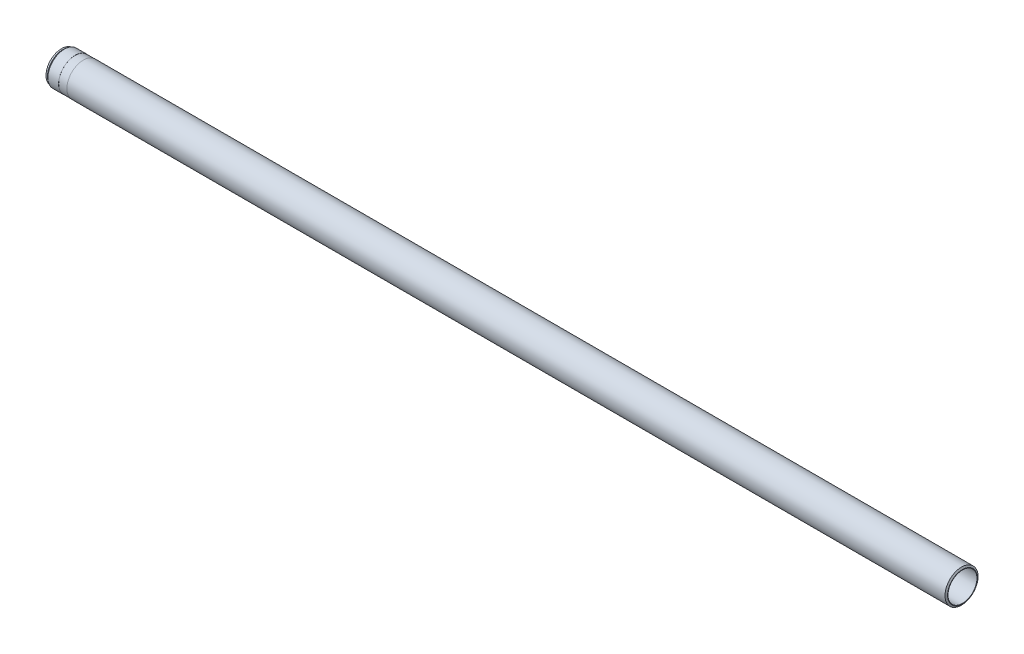
ISO-10303-21;
HEADER;
FILE_DESCRIPTION(('STEP AP214'),'2;1');
FILE_NAME('part.step','',(''),(''),'','','');
FILE_SCHEMA(('AUTOMOTIVE_DESIGN { 1 0 10303 214 1 1 1 1 }'));
ENDSEC;
DATA;
#1=APPLICATION_CONTEXT('core data for automotive mechanical design processes');
#2=APPLICATION_PROTOCOL_DEFINITION('international standard','automotive_design',2000,#1);
#3=PRODUCT_CONTEXT('',#1,'mechanical');
#4=PRODUCT('Part','Part','',(#3));
#5=PRODUCT_RELATED_PRODUCT_CATEGORY('part','',(#4));
#6=PRODUCT_DEFINITION_FORMATION('','',#4);
#7=PRODUCT_DEFINITION_CONTEXT('part definition',#1,'design');
#8=PRODUCT_DEFINITION('design','',#6,#7);
#9=PRODUCT_DEFINITION_SHAPE('','',#8);
#10=(LENGTH_UNIT() NAMED_UNIT(*) SI_UNIT(.MILLI.,.METRE.));
#11=(NAMED_UNIT(*) PLANE_ANGLE_UNIT() SI_UNIT($,.RADIAN.));
#12=(NAMED_UNIT(*) SI_UNIT($,.STERADIAN.) SOLID_ANGLE_UNIT());
#13=UNCERTAINTY_MEASURE_WITH_UNIT(LENGTH_MEASURE(1.E-05),#10,'distance_accuracy_value','');
#14=(GEOMETRIC_REPRESENTATION_CONTEXT(3) GLOBAL_UNCERTAINTY_ASSIGNED_CONTEXT((#13)) GLOBAL_UNIT_ASSIGNED_CONTEXT((#10,
#11,#12)) REPRESENTATION_CONTEXT('',''));
#15=CARTESIAN_POINT('',(0.,0.,0.));
#16=DIRECTION('',(0.,0.,1.));
#17=DIRECTION('',(1.,0.,0.));
#18=AXIS2_PLACEMENT_3D('',#15,#16,#17);
#19=CARTESIAN_POINT('',(0.,0.,0.));
#20=DIRECTION('',(-1.,0.,0.));
#21=DIRECTION('',(0.,0.,1.));
#22=AXIS2_PLACEMENT_3D('',#19,#20,#21);
#23=CONICAL_SURFACE('',#22,36.,1.0471975511966);
#24=CARTESIAN_POINT('',(-2.30940107675837,0.,0.));
#25=DIRECTION('',(-1.,0.,0.));
#26=DIRECTION('',(0.,0.,1.));
#27=AXIS2_PLACEMENT_3D('',#24,#25,#26);
#28=CIRCLE('',#27,40.);
#29=CARTESIAN_POINT('',(-2.30940107675838,0.,40.));
#30=VERTEX_POINT('',#29);
#31=EDGE_CURVE('E10',#30,#30,#28,.T.);
#32=ORIENTED_EDGE('',*,*,#31,.F.);
#33=EDGE_LOOP('',(#32));
#34=FACE_BOUND('',#33,.T.);
#35=CARTESIAN_POINT('',(0.,0.,0.));
#36=DIRECTION('',(-1.,0.,0.));
#37=DIRECTION('',(0.,0.,1.));
#38=AXIS2_PLACEMENT_3D('',#35,#36,#37);
#39=CIRCLE('',#38,36.);
#40=CARTESIAN_POINT('',(0.,0.,36.));
#41=VERTEX_POINT('',#40);
#42=EDGE_CURVE('E91',#41,#41,#39,.T.);
#43=ORIENTED_EDGE('',*,*,#42,.T.);
#44=EDGE_LOOP('',(#43));
#45=FACE_BOUND('',#44,.T.);
#46=ADVANCED_FACE('F45',(#34,#45),#23,.T.);
#47=CARTESIAN_POINT('',(-122.784188741722,0.,0.));
#48=DIRECTION('',(-1.,0.,0.));
#49=DIRECTION('',(0.,0.,1.));
#50=AXIS2_PLACEMENT_3D('',#47,#48,#49);
#51=CYLINDRICAL_SURFACE('',#50,39.9999999999999);
#52=CARTESIAN_POINT('',(-2128.,0.,5.87918759783647E-13));
#53=DIRECTION('',(-1.,0.,0.));
#54=DIRECTION('',(0.,0.,1.));
#55=AXIS2_PLACEMENT_3D('',#52,#53,#54);
#56=CIRCLE('',#55,39.9999999999997);
#57=CARTESIAN_POINT('',(-2128.,0.,40.0000000000003));
#58=VERTEX_POINT('',#57);
#59=EDGE_CURVE('E51',#58,#58,#56,.T.);
#60=ORIENTED_EDGE('',*,*,#59,.F.);
#61=EDGE_LOOP('',(#60));
#62=FACE_BOUND('',#61,.T.);
#63=ORIENTED_EDGE('',*,*,#31,.T.);
#64=EDGE_LOOP('',(#63));
#65=FACE_BOUND('',#64,.T.);
#66=ADVANCED_FACE('F164',(#62,#65),#51,.T.);
#67=CARTESIAN_POINT('',(-2128.,39.9999999999997,5.52391622995642E-13));
#68=DIRECTION('',(1.,0.,0.));
#69=DIRECTION('',(0.,0.,-1.));
#70=AXIS2_PLACEMENT_3D('',#67,#68,#69);
#71=PLANE('',#70);
#72=CARTESIAN_POINT('',(-2128.,0.,5.87918759783647E-13));
#73=DIRECTION('',(-1.,0.,0.));
#74=DIRECTION('',(0.,0.,1.));
#75=AXIS2_PLACEMENT_3D('',#72,#73,#74);
#76=CIRCLE('',#75,39.75);
#77=CARTESIAN_POINT('',(-2128.,0.,39.7500000000006));
#78=VERTEX_POINT('',#77);
#79=EDGE_CURVE('E55',#78,#78,#76,.T.);
#80=ORIENTED_EDGE('',*,*,#79,.F.);
#81=EDGE_LOOP('',(#80));
#82=FACE_BOUND('',#81,.T.);
#83=ORIENTED_EDGE('',*,*,#59,.T.);
#84=EDGE_LOOP('',(#83));
#85=FACE_BOUND('',#84,.T.);
#86=ADVANCED_FACE('F159',(#82,#85),#71,.F.);
#87=CARTESIAN_POINT('',(-122.784188741722,0.,0.));
#88=DIRECTION('',(-1.,0.,0.));
#89=DIRECTION('',(0.,0.,1.));
#90=AXIS2_PLACEMENT_3D('',#87,#88,#89);
#91=CYLINDRICAL_SURFACE('',#90,39.75);
#92=CARTESIAN_POINT('',(-2148.,0.,5.93444312037252E-13));
#93=DIRECTION('',(-1.,0.,0.));
#94=DIRECTION('',(0.,0.,1.));
#95=AXIS2_PLACEMENT_3D('',#92,#93,#94);
#96=CIRCLE('',#95,39.75);
#97=CARTESIAN_POINT('',(-2148.,0.,39.7500000000006));
#98=VERTEX_POINT('',#97);
#99=EDGE_CURVE('E59',#98,#98,#96,.T.);
#100=ORIENTED_EDGE('',*,*,#99,.F.);
#101=EDGE_LOOP('',(#100));
#102=FACE_BOUND('',#101,.T.);
#103=ORIENTED_EDGE('',*,*,#79,.T.);
#104=EDGE_LOOP('',(#103));
#105=FACE_BOUND('',#104,.T.);
#106=ADVANCED_FACE('F153',(#102,#105),#91,.T.);
#107=CARTESIAN_POINT('',(-2148.,39.75,5.58139219854173E-13));
#108=DIRECTION('',(-1.,0.,0.));
#109=DIRECTION('',(0.,0.,1.));
#110=AXIS2_PLACEMENT_3D('',#107,#108,#109);
#111=PLANE('',#110);
#112=CARTESIAN_POINT('',(-2148.,0.,5.93444312037252E-13));
#113=DIRECTION('',(-1.,0.,0.));
#114=DIRECTION('',(0.,0.,1.));
#115=AXIS2_PLACEMENT_3D('',#112,#113,#114);
#116=CIRCLE('',#115,39.9999999999997);
#117=CARTESIAN_POINT('',(-2148.,0.,40.0000000000003));
#118=VERTEX_POINT('',#117);
#119=EDGE_CURVE('E64',#118,#118,#116,.T.);
#120=ORIENTED_EDGE('',*,*,#119,.F.);
#121=EDGE_LOOP('',(#120));
#122=FACE_BOUND('',#121,.T.);
#123=ORIENTED_EDGE('',*,*,#99,.T.);
#124=EDGE_LOOP('',(#123));
#125=FACE_BOUND('',#124,.T.);
#126=ADVANCED_FACE('F147',(#122,#125),#111,.F.);
#127=CARTESIAN_POINT('',(-122.784188741722,0.,0.));
#128=DIRECTION('',(-1.,0.,0.));
#129=DIRECTION('',(0.,0.,1.));
#130=AXIS2_PLACEMENT_3D('',#127,#128,#129);
#131=CYLINDRICAL_SURFACE('',#130,39.9999999999997);
#132=CARTESIAN_POINT('',(-2173.92962998314,0.,6.00608088306679E-13));
#133=DIRECTION('',(-1.,0.,0.));
#134=DIRECTION('',(0.,0.,1.));
#135=AXIS2_PLACEMENT_3D('',#132,#133,#134);
#136=CIRCLE('',#135,39.9999999999998);
#137=CARTESIAN_POINT('',(-2173.92962998314,0.,40.0000000000004));
#138=VERTEX_POINT('',#137);
#139=EDGE_CURVE('E67',#138,#138,#136,.T.);
#140=ORIENTED_EDGE('',*,*,#139,.F.);
#141=EDGE_LOOP('',(#140));
#142=FACE_BOUND('',#141,.T.);
#143=ORIENTED_EDGE('',*,*,#119,.T.);
#144=EDGE_LOOP('',(#143));
#145=FACE_BOUND('',#144,.T.);
#146=ADVANCED_FACE('F141',(#142,#145),#131,.T.);
#147=CARTESIAN_POINT('',(-2173.92962998314,0.,6.00608088306679E-13));
#148=DIRECTION('',(1.,0.,0.));
#149=DIRECTION('',(0.,0.,-1.));
#150=AXIS2_PLACEMENT_3D('',#147,#148,#149);
#151=CONICAL_SURFACE('',#150,39.9999999999998,0.610865238197979);
#152=CARTESIAN_POINT('',(-2177.5,0.,6.01594501611321E-13));
#153=DIRECTION('',(-1.,0.,0.));
#154=DIRECTION('',(0.,0.,1.));
#155=AXIS2_PLACEMENT_3D('',#152,#153,#154);
#156=CIRCLE('',#155,37.5);
#157=CARTESIAN_POINT('',(-2177.5,0.,37.5000000000006));
#158=VERTEX_POINT('',#157);
#159=EDGE_CURVE('E70',#158,#158,#156,.T.);
#160=ORIENTED_EDGE('',*,*,#159,.F.);
#161=EDGE_LOOP('',(#160));
#162=FACE_BOUND('',#161,.T.);
#163=ORIENTED_EDGE('',*,*,#139,.T.);
#164=EDGE_LOOP('',(#163));
#165=FACE_BOUND('',#164,.T.);
#166=ADVANCED_FACE('F135',(#162,#165),#151,.T.);
#167=CARTESIAN_POINT('',(-122.784188741722,0.,0.));
#168=DIRECTION('',(-1.,0.,0.));
#169=DIRECTION('',(0.,0.,1.));
#170=AXIS2_PLACEMENT_3D('',#167,#168,#169);
#171=CYLINDRICAL_SURFACE('',#170,37.5);
#172=CARTESIAN_POINT('',(-2181.,0.,6.02561473255702E-13));
#173=DIRECTION('',(-1.,0.,0.));
#174=DIRECTION('',(0.,0.,1.));
#175=AXIS2_PLACEMENT_3D('',#172,#173,#174);
#176=CIRCLE('',#175,37.5);
#177=CARTESIAN_POINT('',(-2181.,0.,37.5000000000006));
#178=VERTEX_POINT('',#177);
#179=EDGE_CURVE('E73',#178,#178,#176,.T.);
#180=ORIENTED_EDGE('',*,*,#179,.F.);
#181=EDGE_LOOP('',(#180));
#182=FACE_BOUND('',#181,.T.);
#183=ORIENTED_EDGE('',*,*,#159,.T.);
#184=EDGE_LOOP('',(#183));
#185=FACE_BOUND('',#184,.T.);
#186=ADVANCED_FACE('F129',(#182,#185),#171,.T.);
#187=CARTESIAN_POINT('',(-2181.,37.5,5.69254782516947E-13));
#188=DIRECTION('',(1.,0.,0.));
#189=DIRECTION('',(0.,0.,-1.));
#190=AXIS2_PLACEMENT_3D('',#187,#188,#189);
#191=PLANE('',#190);
#192=CARTESIAN_POINT('',(-2181.,0.,6.02561473255702E-13));
#193=DIRECTION('',(-1.,0.,0.));
#194=DIRECTION('',(0.,0.,1.));
#195=AXIS2_PLACEMENT_3D('',#192,#193,#194);
#196=CIRCLE('',#195,35.7273502691896);
#197=CARTESIAN_POINT('',(-2181.,0.,35.7273502691902));
#198=VERTEX_POINT('',#197);
#199=EDGE_CURVE('E76',#198,#198,#196,.T.);
#200=ORIENTED_EDGE('',*,*,#199,.F.);
#201=EDGE_LOOP('',(#200));
#202=FACE_BOUND('',#201,.T.);
#203=ORIENTED_EDGE('',*,*,#179,.T.);
#204=EDGE_LOOP('',(#203));
#205=FACE_BOUND('',#204,.T.);
#206=ADVANCED_FACE('F123',(#202,#205),#191,.F.);
#207=CARTESIAN_POINT('',(-2181.,0.,6.02561473255702E-13));
#208=DIRECTION('',(-1.,0.,0.));
#209=DIRECTION('',(0.,0.,1.));
#210=AXIS2_PLACEMENT_3D('',#207,#208,#209);
#211=CONICAL_SURFACE('',#210,35.7273502691896,0.5235987755983);
#212=CARTESIAN_POINT('',(-2180.,0.,6.02285195643022E-13));
#213=DIRECTION('',(-1.,0.,0.));
#214=DIRECTION('',(0.,0.,1.));
#215=AXIS2_PLACEMENT_3D('',#212,#213,#214);
#216=CIRCLE('',#215,35.15);
#217=CARTESIAN_POINT('',(-2180.,0.,35.1500000000006));
#218=VERTEX_POINT('',#217);
#219=EDGE_CURVE('E79',#218,#218,#216,.T.);
#220=ORIENTED_EDGE('',*,*,#219,.F.);
#221=EDGE_LOOP('',(#220));
#222=FACE_BOUND('',#221,.T.);
#223=ORIENTED_EDGE('',*,*,#199,.T.);
#224=EDGE_LOOP('',(#223));
#225=FACE_BOUND('',#224,.T.);
#226=ADVANCED_FACE('F117',(#222,#225),#211,.F.);
#227=CARTESIAN_POINT('',(-122.784188741722,0.,0.));
#228=DIRECTION('',(-1.,0.,0.));
#229=DIRECTION('',(0.,0.,1.));
#230=AXIS2_PLACEMENT_3D('',#227,#228,#229);
#231=CYLINDRICAL_SURFACE('',#230,35.15);
#232=CARTESIAN_POINT('',(-2166.,0.,5.98417309065497E-13));
#233=DIRECTION('',(-1.,0.,0.));
#234=DIRECTION('',(0.,0.,1.));
#235=AXIS2_PLACEMENT_3D('',#232,#233,#234);
#236=CIRCLE('',#235,35.15);
#237=CARTESIAN_POINT('',(-2166.,0.,35.1500000000006));
#238=VERTEX_POINT('',#237);
#239=EDGE_CURVE('E82',#238,#238,#236,.T.);
#240=ORIENTED_EDGE('',*,*,#239,.F.);
#241=EDGE_LOOP('',(#240));
#242=FACE_BOUND('',#241,.T.);
#243=ORIENTED_EDGE('',*,*,#219,.T.);
#244=EDGE_LOOP('',(#243));
#245=FACE_BOUND('',#244,.T.);
#246=ADVANCED_FACE('F111',(#242,#245),#231,.F.);
#247=CARTESIAN_POINT('',(-2166.,0.,5.98417309065497E-13));
#248=DIRECTION('',(-1.,0.,0.));
#249=DIRECTION('',(0.,0.,1.));
#250=AXIS2_PLACEMENT_3D('',#247,#248,#249);
#251=CONICAL_SURFACE('',#250,35.15,0.523598775597956);
#252=CARTESIAN_POINT('',(-2165.74019237886,0.,5.98345530036174E-13));
#253=DIRECTION('',(-1.,0.,0.));
#254=DIRECTION('',(0.,0.,1.));
#255=AXIS2_PLACEMENT_3D('',#252,#253,#254);
#256=CIRCLE('',#255,35.);
#257=CARTESIAN_POINT('',(-2165.74019237886,0.,35.0000000000006));
#258=VERTEX_POINT('',#257);
#259=EDGE_CURVE('E85',#258,#258,#256,.T.);
#260=ORIENTED_EDGE('',*,*,#259,.F.);
#261=EDGE_LOOP('',(#260));
#262=FACE_BOUND('',#261,.T.);
#263=ORIENTED_EDGE('',*,*,#239,.T.);
#264=EDGE_LOOP('',(#263));
#265=FACE_BOUND('',#264,.T.);
#266=ADVANCED_FACE('F105',(#262,#265),#251,.F.);
#267=CARTESIAN_POINT('',(-122.784188741722,0.,0.));
#268=DIRECTION('',(-1.,0.,0.));
#269=DIRECTION('',(0.,0.,1.));
#270=AXIS2_PLACEMENT_3D('',#267,#268,#269);
#271=CYLINDRICAL_SURFACE('',#270,35.);
#272=CARTESIAN_POINT('',(0.,0.,0.));
#273=DIRECTION('',(-1.,0.,0.));
#274=DIRECTION('',(0.,0.,1.));
#275=AXIS2_PLACEMENT_3D('',#272,#273,#274);
#276=CIRCLE('',#275,35.);
#277=CARTESIAN_POINT('',(0.,0.,35.));
#278=VERTEX_POINT('',#277);
#279=EDGE_CURVE('E88',#278,#278,#276,.T.);
#280=ORIENTED_EDGE('',*,*,#279,.F.);
#281=EDGE_LOOP('',(#280));
#282=FACE_BOUND('',#281,.T.);
#283=ORIENTED_EDGE('',*,*,#259,.T.);
#284=EDGE_LOOP('',(#283));
#285=FACE_BOUND('',#284,.T.);
#286=ADVANCED_FACE('F99',(#282,#285),#271,.F.);
#287=CARTESIAN_POINT('',(0.,35.,0.));
#288=DIRECTION('',(-1.,0.,0.));
#289=DIRECTION('',(0.,0.,1.));
#290=AXIS2_PLACEMENT_3D('',#287,#288,#289);
#291=PLANE('',#290);
#292=ORIENTED_EDGE('',*,*,#42,.F.);
#293=EDGE_LOOP('',(#292));
#294=FACE_BOUND('',#293,.T.);
#295=ORIENTED_EDGE('',*,*,#279,.T.);
#296=EDGE_LOOP('',(#295));
#297=FACE_BOUND('',#296,.T.);
#298=ADVANCED_FACE('F96',(#294,#297),#291,.F.);
#299=CLOSED_SHELL('',(#46,#66,#86,#106,#126,#146,#166,#186,#206,#226,#246,#266,#286,#298));
#300=MANIFOLD_SOLID_BREP('B2',#299);
#301=ADVANCED_BREP_SHAPE_REPRESENTATION('',(#18,#300),#14);
#302=SHAPE_DEFINITION_REPRESENTATION(#9,#301);
ENDSEC;
END-ISO-10303-21;
